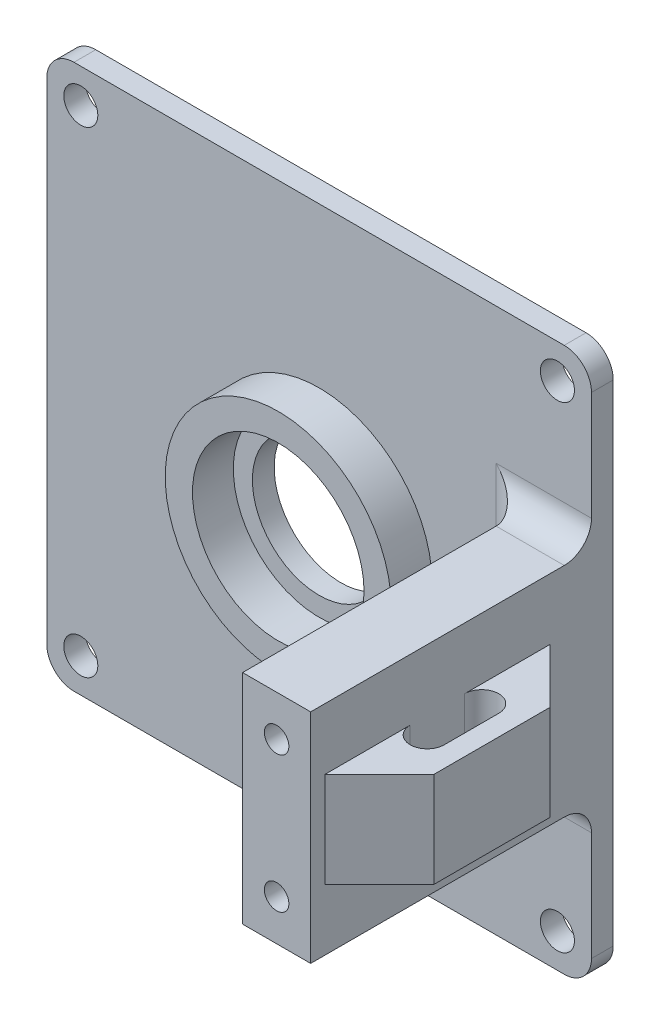
ISO-10303-21;
HEADER;
FILE_DESCRIPTION(('STEP AP214'),'2;1');
FILE_NAME('part.step','',(''),(''),'','','');
FILE_SCHEMA(('AUTOMOTIVE_DESIGN { 1 0 10303 214 1 1 1 1 }'));
ENDSEC;
DATA;
#1=APPLICATION_CONTEXT('core data for automotive mechanical design processes');
#2=APPLICATION_PROTOCOL_DEFINITION('international standard','automotive_design',2000,#1);
#3=PRODUCT_CONTEXT('',#1,'mechanical');
#4=PRODUCT('Part','Part','',(#3));
#5=PRODUCT_RELATED_PRODUCT_CATEGORY('part','',(#4));
#6=PRODUCT_DEFINITION_FORMATION('','',#4);
#7=PRODUCT_DEFINITION_CONTEXT('part definition',#1,'design');
#8=PRODUCT_DEFINITION('design','',#6,#7);
#9=PRODUCT_DEFINITION_SHAPE('','',#8);
#10=(LENGTH_UNIT() NAMED_UNIT(*) SI_UNIT(.MILLI.,.METRE.));
#11=(NAMED_UNIT(*) PLANE_ANGLE_UNIT() SI_UNIT($,.RADIAN.));
#12=(NAMED_UNIT(*) SI_UNIT($,.STERADIAN.) SOLID_ANGLE_UNIT());
#13=UNCERTAINTY_MEASURE_WITH_UNIT(LENGTH_MEASURE(1.E-05),#10,'distance_accuracy_value','');
#14=(GEOMETRIC_REPRESENTATION_CONTEXT(3) GLOBAL_UNCERTAINTY_ASSIGNED_CONTEXT((#13)) GLOBAL_UNIT_ASSIGNED_CONTEXT((#10,
#11,#12)) REPRESENTATION_CONTEXT('',''));
#15=CARTESIAN_POINT('',(0.,0.,0.));
#16=DIRECTION('',(0.,0.,1.));
#17=DIRECTION('',(1.,0.,0.));
#18=AXIS2_PLACEMENT_3D('',#15,#16,#17);
#19=CARTESIAN_POINT('',(0.,0.,2.032));
#20=DIRECTION('',(0.,0.,1.));
#21=DIRECTION('',(1.,0.,0.));
#22=AXIS2_PLACEMENT_3D('',#19,#20,#21);
#23=PLANE('',#22);
#24=CARTESIAN_POINT('',(3.175,47.625,2.032));
#25=DIRECTION('',(0.,0.,1.));
#26=DIRECTION('',(1.,0.,0.));
#27=AXIS2_PLACEMENT_3D('',#24,#25,#26);
#28=CIRCLE('',#27,1.5875);
#29=CARTESIAN_POINT('',(4.7625,47.625,2.032));
#30=VERTEX_POINT('',#29);
#31=EDGE_CURVE('E276',#30,#30,#28,.T.);
#32=ORIENTED_EDGE('',*,*,#31,.F.);
#33=EDGE_LOOP('',(#32));
#34=FACE_BOUND('',#33,.T.);
#35=CARTESIAN_POINT('',(3.175,3.175,2.032));
#36=DIRECTION('',(0.,0.,1.));
#37=DIRECTION('',(1.,0.,0.));
#38=AXIS2_PLACEMENT_3D('',#35,#36,#37);
#39=CIRCLE('',#38,1.5875);
#40=CARTESIAN_POINT('',(4.7625,3.175,2.032));
#41=VERTEX_POINT('',#40);
#42=EDGE_CURVE('E270',#41,#41,#39,.T.);
#43=ORIENTED_EDGE('',*,*,#42,.F.);
#44=EDGE_LOOP('',(#43));
#45=FACE_BOUND('',#44,.T.);
#46=CARTESIAN_POINT('',(47.625,3.17500000000001,2.032));
#47=DIRECTION('',(0.,0.,1.));
#48=DIRECTION('',(1.,0.,0.));
#49=AXIS2_PLACEMENT_3D('',#46,#47,#48);
#50=CIRCLE('',#49,1.5875);
#51=CARTESIAN_POINT('',(49.2125,3.17500000000001,2.032));
#52=VERTEX_POINT('',#51);
#53=EDGE_CURVE('E264',#52,#52,#50,.T.);
#54=ORIENTED_EDGE('',*,*,#53,.F.);
#55=EDGE_LOOP('',(#54));
#56=FACE_BOUND('',#55,.T.);
#57=CARTESIAN_POINT('',(47.625,47.625,2.032));
#58=DIRECTION('',(0.,0.,1.));
#59=DIRECTION('',(1.,0.,0.));
#60=AXIS2_PLACEMENT_3D('',#57,#58,#59);
#61=CIRCLE('',#60,1.5875);
#62=CARTESIAN_POINT('',(49.2125,47.625,2.032));
#63=VERTEX_POINT('',#62);
#64=EDGE_CURVE('E263',#63,#63,#61,.T.);
#65=ORIENTED_EDGE('',*,*,#64,.F.);
#66=EDGE_LOOP('',(#65));
#67=FACE_BOUND('',#66,.T.);
#68=CARTESIAN_POINT('',(25.4,25.4,2.032));
#69=DIRECTION('',(0.,0.,1.));
#70=DIRECTION('',(1.,0.,0.));
#71=AXIS2_PLACEMENT_3D('',#68,#69,#70);
#72=CIRCLE('',#71,10.541);
#73=CARTESIAN_POINT('',(35.941,25.4,2.032));
#74=VERTEX_POINT('',#73);
#75=EDGE_CURVE('E343',#74,#74,#72,.T.);
#76=ORIENTED_EDGE('',*,*,#75,.F.);
#77=EDGE_LOOP('',(#76));
#78=FACE_BOUND('',#77,.T.);
#79=DIRECTION('',(0.,1.,0.));
#80=VECTOR('',#79,1.);
#81=CARTESIAN_POINT('',(0.,0.,2.032));
#82=LINE('',#81,#80);
#83=CARTESIAN_POINT('',(0.,2.54,2.032));
#84=VERTEX_POINT('',#83);
#85=CARTESIAN_POINT('',(0.,48.26,2.032));
#86=VERTEX_POINT('',#85);
#87=EDGE_CURVE('E347',#84,#86,#82,.T.);
#88=ORIENTED_EDGE('',*,*,#87,.F.);
#89=CARTESIAN_POINT('',(2.54,2.54,2.032));
#90=DIRECTION('',(0.,0.,1.));
#91=DIRECTION('',(1.,0.,0.));
#92=AXIS2_PLACEMENT_3D('',#89,#90,#91);
#93=CIRCLE('',#92,2.54);
#94=CARTESIAN_POINT('',(2.54,0.,2.032));
#95=VERTEX_POINT('',#94);
#96=EDGE_CURVE('E418',#84,#95,#93,.T.);
#97=ORIENTED_EDGE('',*,*,#96,.T.);
#98=DIRECTION('',(1.,0.,0.));
#99=VECTOR('',#98,1.);
#100=CARTESIAN_POINT('',(0.,0.,2.032));
#101=LINE('',#100,#99);
#102=CARTESIAN_POINT('',(48.26,0.,2.032));
#103=VERTEX_POINT('',#102);
#104=EDGE_CURVE('E348',#95,#103,#101,.T.);
#105=ORIENTED_EDGE('',*,*,#104,.T.);
#106=CARTESIAN_POINT('',(48.26,2.54,2.032));
#107=DIRECTION('',(0.,0.,1.));
#108=DIRECTION('',(1.,0.,0.));
#109=AXIS2_PLACEMENT_3D('',#106,#107,#108);
#110=CIRCLE('',#109,2.54);
#111=CARTESIAN_POINT('',(50.8,2.54,2.032));
#112=VERTEX_POINT('',#111);
#113=EDGE_CURVE('E416',#103,#112,#110,.T.);
#114=ORIENTED_EDGE('',*,*,#113,.T.);
#115=DIRECTION('',(0.,1.,0.));
#116=VECTOR('',#115,1.);
#117=CARTESIAN_POINT('',(50.8,0.,2.032));
#118=LINE('',#117,#116);
#119=CARTESIAN_POINT('',(50.8,12.7,2.032));
#120=VERTEX_POINT('',#119);
#121=EDGE_CURVE('E353',#112,#120,#118,.T.);
#122=ORIENTED_EDGE('',*,*,#121,.T.);
#123=DIRECTION('',(-1.,0.,0.));
#124=VECTOR('',#123,1.);
#125=CARTESIAN_POINT('',(44.45,12.7,2.032));
#126=LINE('',#125,#124);
#127=CARTESIAN_POINT('',(41.91,12.7,2.032));
#128=VERTEX_POINT('',#127);
#129=EDGE_CURVE('E378',#120,#128,#126,.T.);
#130=ORIENTED_EDGE('',*,*,#129,.T.);
#131=DIRECTION('',(0.,-1.,0.));
#132=VECTOR('',#131,1.);
#133=CARTESIAN_POINT('',(41.91,0.,2.032));
#134=LINE('',#133,#132);
#135=CARTESIAN_POINT('',(41.91,38.1,2.032));
#136=VERTEX_POINT('',#135);
#137=EDGE_CURVE('E376',#128,#136,#134,.F.);
#138=ORIENTED_EDGE('',*,*,#137,.T.);
#139=DIRECTION('',(-1.,0.,0.));
#140=VECTOR('',#139,1.);
#141=CARTESIAN_POINT('',(0.,38.1,2.032));
#142=LINE('',#141,#140);
#143=CARTESIAN_POINT('',(50.8,38.1,2.032));
#144=VERTEX_POINT('',#143);
#145=EDGE_CURVE('E380',#136,#144,#142,.F.);
#146=ORIENTED_EDGE('',*,*,#145,.T.);
#147=CARTESIAN_POINT('',(50.8,48.26,2.032));
#148=VERTEX_POINT('',#147);
#149=EDGE_CURVE('E351',#144,#148,#118,.T.);
#150=ORIENTED_EDGE('',*,*,#149,.T.);
#151=CARTESIAN_POINT('',(48.26,48.26,2.032));
#152=DIRECTION('',(0.,0.,1.));
#153=DIRECTION('',(1.,0.,0.));
#154=AXIS2_PLACEMENT_3D('',#151,#152,#153);
#155=CIRCLE('',#154,2.54);
#156=CARTESIAN_POINT('',(48.26,50.8,2.032));
#157=VERTEX_POINT('',#156);
#158=EDGE_CURVE('E414',#148,#157,#155,.T.);
#159=ORIENTED_EDGE('',*,*,#158,.T.);
#160=DIRECTION('',(1.,0.,0.));
#161=VECTOR('',#160,1.);
#162=CARTESIAN_POINT('',(0.,50.8,2.032));
#163=LINE('',#162,#161);
#164=CARTESIAN_POINT('',(2.54,50.8,2.032));
#165=VERTEX_POINT('',#164);
#166=EDGE_CURVE('E355',#165,#157,#163,.T.);
#167=ORIENTED_EDGE('',*,*,#166,.F.);
#168=CARTESIAN_POINT('',(2.54,48.26,2.032));
#169=DIRECTION('',(0.,0.,1.));
#170=DIRECTION('',(1.,0.,0.));
#171=AXIS2_PLACEMENT_3D('',#168,#169,#170);
#172=CIRCLE('',#171,2.54);
#173=EDGE_CURVE('E412',#165,#86,#172,.T.);
#174=ORIENTED_EDGE('',*,*,#173,.T.);
#175=EDGE_LOOP('',(#88,#97,#105,#114,#122,#130,#138,#146,#150,#159,#167,#174));
#176=FACE_BOUND('',#175,.T.);
#177=ADVANCED_FACE('F43',(#34,#45,#56,#67,#78,#176),#23,.T.);
#178=CARTESIAN_POINT('',(0.,0.,2.032));
#179=DIRECTION('',(0.,1.,0.));
#180=DIRECTION('',(0.,0.,1.));
#181=AXIS2_PLACEMENT_3D('',#178,#179,#180);
#182=PLANE('',#181);
#183=ORIENTED_EDGE('',*,*,#104,.F.);
#184=DIRECTION('',(0.,0.,-1.));
#185=VECTOR('',#184,1.);
#186=CARTESIAN_POINT('',(2.54,0.,0.));
#187=LINE('',#186,#185);
#188=CARTESIAN_POINT('',(2.54,0.,0.));
#189=VERTEX_POINT('',#188);
#190=EDGE_CURVE('E396',#95,#189,#187,.T.);
#191=ORIENTED_EDGE('',*,*,#190,.T.);
#192=DIRECTION('',(1.,0.,0.));
#193=VECTOR('',#192,1.);
#194=CARTESIAN_POINT('',(0.,0.,0.));
#195=LINE('',#194,#193);
#196=CARTESIAN_POINT('',(48.26,0.,0.));
#197=VERTEX_POINT('',#196);
#198=EDGE_CURVE('E342',#189,#197,#195,.T.);
#199=ORIENTED_EDGE('',*,*,#198,.T.);
#200=DIRECTION('',(0.,0.,-1.));
#201=VECTOR('',#200,1.);
#202=CARTESIAN_POINT('',(48.26,0.,2.032));
#203=LINE('',#202,#201);
#204=EDGE_CURVE('E391',#197,#103,#203,.F.);
#205=ORIENTED_EDGE('',*,*,#204,.T.);
#206=EDGE_LOOP('',(#183,#191,#199,#205));
#207=FACE_BOUND('',#206,.T.);
#208=ADVANCED_FACE('F450',(#207),#182,.F.);
#209=CARTESIAN_POINT('',(50.8,0.,2.032));
#210=DIRECTION('',(-1.,0.,0.));
#211=DIRECTION('',(0.,0.,1.));
#212=AXIS2_PLACEMENT_3D('',#209,#210,#211);
#213=PLANE('',#212);
#214=DIRECTION('',(0.,1.,0.));
#215=VECTOR('',#214,1.);
#216=CARTESIAN_POINT('',(50.8,20.955,5.91820000000006));
#217=LINE('',#216,#215);
#218=CARTESIAN_POINT('',(50.8,20.955,5.91820000000005));
#219=VERTEX_POINT('',#218);
#220=CARTESIAN_POINT('',(50.8,29.845,5.91820000000006));
#221=VERTEX_POINT('',#220);
#222=EDGE_CURVE('E63',#219,#221,#217,.T.);
#223=ORIENTED_EDGE('',*,*,#222,.F.);
#224=DIRECTION('',(0.,0.,1.));
#225=VECTOR('',#224,1.);
#226=CARTESIAN_POINT('',(50.8,20.955,0.));
#227=LINE('',#226,#225);
#228=CARTESIAN_POINT('',(50.8,20.955,13.8557));
#229=VERTEX_POINT('',#228);
#230=EDGE_CURVE('E58',#219,#229,#227,.T.);
#231=ORIENTED_EDGE('',*,*,#230,.T.);
#232=DIRECTION('',(0.,1.,0.));
#233=VECTOR('',#232,1.);
#234=CARTESIAN_POINT('',(50.8,20.955,13.8557));
#235=LINE('',#234,#233);
#236=CARTESIAN_POINT('',(50.8,29.845,13.8557));
#237=VERTEX_POINT('',#236);
#238=EDGE_CURVE('E257',#229,#237,#235,.T.);
#239=ORIENTED_EDGE('',*,*,#238,.T.);
#240=DIRECTION('',(0.,0.,1.));
#241=VECTOR('',#240,1.);
#242=CARTESIAN_POINT('',(50.8,29.845,0.));
#243=LINE('',#242,#241);
#244=EDGE_CURVE('E236',#221,#237,#243,.T.);
#245=ORIENTED_EDGE('',*,*,#244,.F.);
#246=EDGE_LOOP('',(#223,#231,#239,#245));
#247=FACE_BOUND('',#246,.T.);
#248=DIRECTION('',(0.,1.,0.));
#249=VECTOR('',#248,1.);
#250=CARTESIAN_POINT('',(50.8,20.955,18.9357));
#251=LINE('',#250,#249);
#252=CARTESIAN_POINT('',(50.8,20.955,18.9357));
#253=VERTEX_POINT('',#252);
#254=CARTESIAN_POINT('',(50.8,29.845,18.9357));
#255=VERTEX_POINT('',#254);
#256=EDGE_CURVE('E229',#253,#255,#251,.T.);
#257=ORIENTED_EDGE('',*,*,#256,.F.);
#258=DIRECTION('',(0.,0.,-1.));
#259=VECTOR('',#258,1.);
#260=CARTESIAN_POINT('',(50.8,20.955,0.));
#261=LINE('',#260,#259);
#262=CARTESIAN_POINT('',(50.8,20.955,26.8732));
#263=VERTEX_POINT('',#262);
#264=EDGE_CURVE('E212',#263,#253,#261,.T.);
#265=ORIENTED_EDGE('',*,*,#264,.F.);
#266=DIRECTION('',(0.,1.,0.));
#267=VECTOR('',#266,1.);
#268=CARTESIAN_POINT('',(50.8,20.955,26.8732));
#269=LINE('',#268,#267);
#270=CARTESIAN_POINT('',(50.8,29.845,26.8732));
#271=VERTEX_POINT('',#270);
#272=EDGE_CURVE('E249',#263,#271,#269,.T.);
#273=ORIENTED_EDGE('',*,*,#272,.T.);
#274=DIRECTION('',(0.,0.,-1.));
#275=VECTOR('',#274,1.);
#276=CARTESIAN_POINT('',(50.8,29.845,0.));
#277=LINE('',#276,#275);
#278=EDGE_CURVE('E213',#271,#255,#277,.T.);
#279=ORIENTED_EDGE('',*,*,#278,.T.);
#280=EDGE_LOOP('',(#257,#265,#273,#279));
#281=FACE_BOUND('',#280,.T.);
#282=ORIENTED_EDGE('',*,*,#121,.F.);
#283=DIRECTION('',(0.,0.,-1.));
#284=VECTOR('',#283,1.);
#285=CARTESIAN_POINT('',(50.8,2.54,2.032));
#286=LINE('',#285,#284);
#287=CARTESIAN_POINT('',(50.8,2.54,0.));
#288=VERTEX_POINT('',#287);
#289=EDGE_CURVE('E422',#112,#288,#286,.T.);
#290=ORIENTED_EDGE('',*,*,#289,.T.);
#291=DIRECTION('',(0.,1.,0.));
#292=VECTOR('',#291,1.);
#293=CARTESIAN_POINT('',(50.8,0.,0.));
#294=LINE('',#293,#292);
#295=CARTESIAN_POINT('',(50.8,48.26,0.));
#296=VERTEX_POINT('',#295);
#297=EDGE_CURVE('E362',#288,#296,#294,.T.);
#298=ORIENTED_EDGE('',*,*,#297,.T.);
#299=DIRECTION('',(0.,0.,-1.));
#300=VECTOR('',#299,1.);
#301=CARTESIAN_POINT('',(50.8,48.26,2.032));
#302=LINE('',#301,#300);
#303=EDGE_CURVE('E420',#296,#148,#302,.F.);
#304=ORIENTED_EDGE('',*,*,#303,.T.);
#305=ORIENTED_EDGE('',*,*,#149,.F.);
#306=CARTESIAN_POINT('',(50.8,38.1,4.572));
#307=DIRECTION('',(-1.,0.,0.));
#308=DIRECTION('',(0.,0.,1.));
#309=AXIS2_PLACEMENT_3D('',#306,#307,#308);
#310=CIRCLE('',#309,2.54);
#311=CARTESIAN_POINT('',(50.8,35.56,4.572));
#312=VERTEX_POINT('',#311);
#313=EDGE_CURVE('E386',#144,#312,#310,.T.);
#314=ORIENTED_EDGE('',*,*,#313,.T.);
#315=DIRECTION('',(0.,0.,-1.));
#316=VECTOR('',#315,1.);
#317=CARTESIAN_POINT('',(50.8,35.56,28.2194));
#318=LINE('',#317,#316);
#319=CARTESIAN_POINT('',(50.8,35.56,28.2194));
#320=VERTEX_POINT('',#319);
#321=EDGE_CURVE('E316',#320,#312,#318,.T.);
#322=ORIENTED_EDGE('',*,*,#321,.F.);
#323=DIRECTION('',(0.,-1.,0.));
#324=VECTOR('',#323,1.);
#325=CARTESIAN_POINT('',(50.8,35.56,28.2194));
#326=LINE('',#325,#324);
#327=CARTESIAN_POINT('',(50.8,15.24,28.2194));
#328=VERTEX_POINT('',#327);
#329=EDGE_CURVE('E295',#320,#328,#326,.T.);
#330=ORIENTED_EDGE('',*,*,#329,.T.);
#331=DIRECTION('',(0.,0.,-1.));
#332=VECTOR('',#331,1.);
#333=CARTESIAN_POINT('',(50.8,15.24,28.2194));
#334=LINE('',#333,#332);
#335=CARTESIAN_POINT('',(50.8,15.24,4.572));
#336=VERTEX_POINT('',#335);
#337=EDGE_CURVE('E315',#328,#336,#334,.T.);
#338=ORIENTED_EDGE('',*,*,#337,.T.);
#339=CARTESIAN_POINT('',(50.8,12.7,4.572));
#340=DIRECTION('',(-1.,0.,0.));
#341=DIRECTION('',(0.,0.,1.));
#342=AXIS2_PLACEMENT_3D('',#339,#340,#341);
#343=CIRCLE('',#342,2.54);
#344=EDGE_CURVE('E388',#336,#120,#343,.T.);
#345=ORIENTED_EDGE('',*,*,#344,.T.);
#346=EDGE_LOOP('',(#282,#290,#298,#304,#305,#314,#322,#330,#338,#345));
#347=FACE_BOUND('',#346,.T.);
#348=ADVANCED_FACE('F459',(#247,#281,#347),#213,.F.);
#349=CARTESIAN_POINT('',(0.,50.8,2.032));
#350=DIRECTION('',(0.,1.,0.));
#351=DIRECTION('',(0.,0.,1.));
#352=AXIS2_PLACEMENT_3D('',#349,#350,#351);
#353=PLANE('',#352);
#354=ORIENTED_EDGE('',*,*,#166,.T.);
#355=DIRECTION('',(0.,0.,-1.));
#356=VECTOR('',#355,1.);
#357=CARTESIAN_POINT('',(48.26,50.8,0.));
#358=LINE('',#357,#356);
#359=CARTESIAN_POINT('',(48.26,50.8,0.));
#360=VERTEX_POINT('',#359);
#361=EDGE_CURVE('E12',#157,#360,#358,.T.);
#362=ORIENTED_EDGE('',*,*,#361,.T.);
#363=DIRECTION('',(1.,0.,0.));
#364=VECTOR('',#363,1.);
#365=CARTESIAN_POINT('',(0.,50.8,0.));
#366=LINE('',#365,#364);
#367=CARTESIAN_POINT('',(2.54,50.8,0.));
#368=VERTEX_POINT('',#367);
#369=EDGE_CURVE('E365',#368,#360,#366,.T.);
#370=ORIENTED_EDGE('',*,*,#369,.F.);
#371=DIRECTION('',(0.,0.,-1.));
#372=VECTOR('',#371,1.);
#373=CARTESIAN_POINT('',(2.54,50.8,2.032));
#374=LINE('',#373,#372);
#375=EDGE_CURVE('E51',#368,#165,#374,.F.);
#376=ORIENTED_EDGE('',*,*,#375,.T.);
#377=EDGE_LOOP('',(#354,#362,#370,#376));
#378=FACE_BOUND('',#377,.T.);
#379=ADVANCED_FACE('F428',(#378),#353,.T.);
#380=CARTESIAN_POINT('',(0.,0.,2.032));
#381=DIRECTION('',(-1.,0.,0.));
#382=DIRECTION('',(0.,0.,1.));
#383=AXIS2_PLACEMENT_3D('',#380,#381,#382);
#384=PLANE('',#383);
#385=DIRECTION('',(0.,1.,0.));
#386=VECTOR('',#385,1.);
#387=CARTESIAN_POINT('',(0.,0.,0.));
#388=LINE('',#387,#386);
#389=CARTESIAN_POINT('',(0.,2.54,0.));
#390=VERTEX_POINT('',#389);
#391=CARTESIAN_POINT('',(0.,48.26,0.));
#392=VERTEX_POINT('',#391);
#393=EDGE_CURVE('E352',#390,#392,#388,.T.);
#394=ORIENTED_EDGE('',*,*,#393,.F.);
#395=DIRECTION('',(0.,0.,-1.));
#396=VECTOR('',#395,1.);
#397=CARTESIAN_POINT('',(0.,2.54,2.032));
#398=LINE('',#397,#396);
#399=EDGE_CURVE('E410',#390,#84,#398,.F.);
#400=ORIENTED_EDGE('',*,*,#399,.T.);
#401=ORIENTED_EDGE('',*,*,#87,.T.);
#402=DIRECTION('',(0.,0.,-1.));
#403=VECTOR('',#402,1.);
#404=CARTESIAN_POINT('',(0.,48.26,2.032));
#405=LINE('',#404,#403);
#406=EDGE_CURVE('E407',#86,#392,#405,.T.);
#407=ORIENTED_EDGE('',*,*,#406,.T.);
#408=EDGE_LOOP('',(#394,#400,#401,#407));
#409=FACE_BOUND('',#408,.T.);
#410=ADVANCED_FACE('F439',(#409),#384,.T.);
#411=CARTESIAN_POINT('',(0.,0.,0.));
#412=DIRECTION('',(0.,0.,1.));
#413=DIRECTION('',(1.,0.,0.));
#414=AXIS2_PLACEMENT_3D('',#411,#412,#413);
#415=PLANE('',#414);
#416=CARTESIAN_POINT('',(3.175,47.625,0.));
#417=DIRECTION('',(0.,0.,1.));
#418=DIRECTION('',(1.,0.,0.));
#419=AXIS2_PLACEMENT_3D('',#416,#417,#418);
#420=CIRCLE('',#419,1.5875);
#421=CARTESIAN_POINT('',(4.7625,47.625,0.));
#422=VERTEX_POINT('',#421);
#423=EDGE_CURVE('E273',#422,#422,#420,.T.);
#424=ORIENTED_EDGE('',*,*,#423,.T.);
#425=EDGE_LOOP('',(#424));
#426=FACE_BOUND('',#425,.T.);
#427=CARTESIAN_POINT('',(3.175,3.175,0.));
#428=DIRECTION('',(0.,0.,1.));
#429=DIRECTION('',(1.,0.,0.));
#430=AXIS2_PLACEMENT_3D('',#427,#428,#429);
#431=CIRCLE('',#430,1.5875);
#432=CARTESIAN_POINT('',(4.7625,3.175,0.));
#433=VERTEX_POINT('',#432);
#434=EDGE_CURVE('E267',#433,#433,#431,.T.);
#435=ORIENTED_EDGE('',*,*,#434,.T.);
#436=EDGE_LOOP('',(#435));
#437=FACE_BOUND('',#436,.T.);
#438=CARTESIAN_POINT('',(47.625,3.17500000000001,0.));
#439=DIRECTION('',(0.,0.,1.));
#440=DIRECTION('',(1.,0.,0.));
#441=AXIS2_PLACEMENT_3D('',#438,#439,#440);
#442=CIRCLE('',#441,1.5875);
#443=CARTESIAN_POINT('',(49.2125,3.17500000000001,0.));
#444=VERTEX_POINT('',#443);
#445=EDGE_CURVE('E260',#444,#444,#442,.T.);
#446=ORIENTED_EDGE('',*,*,#445,.T.);
#447=EDGE_LOOP('',(#446));
#448=FACE_BOUND('',#447,.T.);
#449=CARTESIAN_POINT('',(47.625,47.625,0.));
#450=DIRECTION('',(0.,0.,1.));
#451=DIRECTION('',(1.,0.,0.));
#452=AXIS2_PLACEMENT_3D('',#449,#450,#451);
#453=CIRCLE('',#452,1.5875);
#454=CARTESIAN_POINT('',(49.2125,47.625,0.));
#455=VERTEX_POINT('',#454);
#456=EDGE_CURVE('E280',#455,#455,#453,.T.);
#457=ORIENTED_EDGE('',*,*,#456,.T.);
#458=EDGE_LOOP('',(#457));
#459=FACE_BOUND('',#458,.T.);
#460=CARTESIAN_POINT('',(25.4,25.4,0.));
#461=DIRECTION('',(0.,0.,1.));
#462=DIRECTION('',(1.,0.,0.));
#463=AXIS2_PLACEMENT_3D('',#460,#461,#462);
#464=CIRCLE('',#463,6.223);
#465=CARTESIAN_POINT('',(31.623,25.4,0.));
#466=VERTEX_POINT('',#465);
#467=EDGE_CURVE('E328',#466,#466,#464,.T.);
#468=ORIENTED_EDGE('',*,*,#467,.T.);
#469=EDGE_LOOP('',(#468));
#470=FACE_BOUND('',#469,.T.);
#471=ORIENTED_EDGE('',*,*,#198,.F.);
#472=CARTESIAN_POINT('',(2.54,2.54,0.));
#473=DIRECTION('',(0.,0.,1.));
#474=DIRECTION('',(1.,0.,0.));
#475=AXIS2_PLACEMENT_3D('',#472,#473,#474);
#476=CIRCLE('',#475,2.54);
#477=EDGE_CURVE('E405',#189,#390,#476,.F.);
#478=ORIENTED_EDGE('',*,*,#477,.T.);
#479=ORIENTED_EDGE('',*,*,#393,.T.);
#480=CARTESIAN_POINT('',(2.54,48.26,0.));
#481=DIRECTION('',(0.,0.,1.));
#482=DIRECTION('',(1.,0.,0.));
#483=AXIS2_PLACEMENT_3D('',#480,#481,#482);
#484=CIRCLE('',#483,2.54);
#485=EDGE_CURVE('E399',#392,#368,#484,.F.);
#486=ORIENTED_EDGE('',*,*,#485,.T.);
#487=ORIENTED_EDGE('',*,*,#369,.T.);
#488=CARTESIAN_POINT('',(48.26,48.26,0.));
#489=DIRECTION('',(0.,0.,1.));
#490=DIRECTION('',(1.,0.,0.));
#491=AXIS2_PLACEMENT_3D('',#488,#489,#490);
#492=CIRCLE('',#491,2.54);
#493=EDGE_CURVE('E401',#360,#296,#492,.F.);
#494=ORIENTED_EDGE('',*,*,#493,.T.);
#495=ORIENTED_EDGE('',*,*,#297,.F.);
#496=CARTESIAN_POINT('',(48.26,2.54,0.));
#497=DIRECTION('',(0.,0.,1.));
#498=DIRECTION('',(1.,0.,0.));
#499=AXIS2_PLACEMENT_3D('',#496,#497,#498);
#500=CIRCLE('',#499,2.54);
#501=EDGE_CURVE('E403',#288,#197,#500,.F.);
#502=ORIENTED_EDGE('',*,*,#501,.T.);
#503=EDGE_LOOP('',(#471,#478,#479,#486,#487,#494,#495,#502));
#504=FACE_BOUND('',#503,.T.);
#505=ADVANCED_FACE('F443',(#426,#437,#448,#459,#470,#504),#415,.F.);
#506=CARTESIAN_POINT('',(25.4,25.4,5.842));
#507=DIRECTION('',(0.,0.,-1.));
#508=DIRECTION('',(-1.,0.,0.));
#509=AXIS2_PLACEMENT_3D('',#506,#507,#508);
#510=CYLINDRICAL_SURFACE('',#509,10.541);
#511=CARTESIAN_POINT('',(25.4,25.4,5.842));
#512=DIRECTION('',(0.,0.,1.));
#513=DIRECTION('',(1.,0.,0.));
#514=AXIS2_PLACEMENT_3D('',#511,#512,#513);
#515=CIRCLE('',#514,10.541);
#516=CARTESIAN_POINT('',(35.941,25.4,5.842));
#517=VERTEX_POINT('',#516);
#518=EDGE_CURVE('E337',#517,#517,#515,.T.);
#519=ORIENTED_EDGE('',*,*,#518,.F.);
#520=EDGE_LOOP('',(#519));
#521=FACE_BOUND('',#520,.T.);
#522=ORIENTED_EDGE('',*,*,#75,.T.);
#523=EDGE_LOOP('',(#522));
#524=FACE_BOUND('',#523,.T.);
#525=ADVANCED_FACE('F517',(#521,#524),#510,.T.);
#526=CARTESIAN_POINT('',(0.,0.,5.842));
#527=DIRECTION('',(0.,0.,1.));
#528=DIRECTION('',(1.,0.,0.));
#529=AXIS2_PLACEMENT_3D('',#526,#527,#528);
#530=PLANE('',#529);
#531=CARTESIAN_POINT('',(25.4,25.4,5.842));
#532=DIRECTION('',(0.,0.,1.));
#533=DIRECTION('',(1.,0.,0.));
#534=AXIS2_PLACEMENT_3D('',#531,#532,#533);
#535=CIRCLE('',#534,8.001);
#536=CARTESIAN_POINT('',(33.401,25.4,5.842));
#537=VERTEX_POINT('',#536);
#538=EDGE_CURVE('E334',#537,#537,#535,.T.);
#539=ORIENTED_EDGE('',*,*,#538,.F.);
#540=EDGE_LOOP('',(#539));
#541=FACE_BOUND('',#540,.T.);
#542=ORIENTED_EDGE('',*,*,#518,.T.);
#543=EDGE_LOOP('',(#542));
#544=FACE_BOUND('',#543,.T.);
#545=ADVANCED_FACE('F617',(#541,#544),#530,.T.);
#546=CARTESIAN_POINT('',(25.4,25.4,5.842));
#547=DIRECTION('',(0.,0.,-1.));
#548=DIRECTION('',(-1.,0.,0.));
#549=AXIS2_PLACEMENT_3D('',#546,#547,#548);
#550=CYLINDRICAL_SURFACE('',#549,8.001);
#551=ORIENTED_EDGE('',*,*,#538,.T.);
#552=EDGE_LOOP('',(#551));
#553=FACE_BOUND('',#552,.T.);
#554=CARTESIAN_POINT('',(25.4,25.4,2.032));
#555=DIRECTION('',(0.,0.,1.));
#556=DIRECTION('',(1.,0.,0.));
#557=AXIS2_PLACEMENT_3D('',#554,#555,#556);
#558=CIRCLE('',#557,8.001);
#559=CARTESIAN_POINT('',(33.401,25.4,2.032));
#560=VERTEX_POINT('',#559);
#561=EDGE_CURVE('E331',#560,#560,#558,.T.);
#562=ORIENTED_EDGE('',*,*,#561,.F.);
#563=EDGE_LOOP('',(#562));
#564=FACE_BOUND('',#563,.T.);
#565=ADVANCED_FACE('F610',(#553,#564),#550,.F.);
#566=CARTESIAN_POINT('',(25.4,25.4,2.032));
#567=DIRECTION('',(0.,0.,1.));
#568=DIRECTION('',(1.,0.,0.));
#569=AXIS2_PLACEMENT_3D('',#566,#567,#568);
#570=PLANE('',#569);
#571=CARTESIAN_POINT('',(25.4,25.4,2.032));
#572=DIRECTION('',(0.,0.,1.));
#573=DIRECTION('',(1.,0.,0.));
#574=AXIS2_PLACEMENT_3D('',#571,#572,#573);
#575=CIRCLE('',#574,6.223);
#576=CARTESIAN_POINT('',(31.623,25.4,2.032));
#577=VERTEX_POINT('',#576);
#578=EDGE_CURVE('E319',#577,#577,#575,.T.);
#579=ORIENTED_EDGE('',*,*,#578,.F.);
#580=EDGE_LOOP('',(#579));
#581=FACE_BOUND('',#580,.T.);
#582=ORIENTED_EDGE('',*,*,#561,.T.);
#583=EDGE_LOOP('',(#582));
#584=FACE_BOUND('',#583,.T.);
#585=ADVANCED_FACE('F604',(#581,#584),#570,.T.);
#586=CARTESIAN_POINT('',(25.4,25.4,0.));
#587=DIRECTION('',(0.,0.,1.));
#588=DIRECTION('',(1.,0.,0.));
#589=AXIS2_PLACEMENT_3D('',#586,#587,#588);
#590=CYLINDRICAL_SURFACE('',#589,6.223);
#591=ORIENTED_EDGE('',*,*,#467,.F.);
#592=EDGE_LOOP('',(#591));
#593=FACE_BOUND('',#592,.T.);
#594=ORIENTED_EDGE('',*,*,#578,.T.);
#595=EDGE_LOOP('',(#594));
#596=FACE_BOUND('',#595,.T.);
#597=ADVANCED_FACE('F600',(#593,#596),#590,.F.);
#598=CARTESIAN_POINT('',(50.8,35.56,28.2194));
#599=DIRECTION('',(0.,-1.,0.));
#600=DIRECTION('',(0.,0.,-1.));
#601=AXIS2_PLACEMENT_3D('',#598,#599,#600);
#602=PLANE('',#601);
#603=ORIENTED_EDGE('',*,*,#321,.T.);
#604=DIRECTION('',(-1.,0.,0.));
#605=VECTOR('',#604,1.);
#606=CARTESIAN_POINT('',(50.8,35.56,4.572));
#607=LINE('',#606,#605);
#608=CARTESIAN_POINT('',(44.45,35.56,4.572));
#609=VERTEX_POINT('',#608);
#610=EDGE_CURVE('E346',#312,#609,#607,.T.);
#611=ORIENTED_EDGE('',*,*,#610,.T.);
#612=DIRECTION('',(0.,0.,-1.));
#613=VECTOR('',#612,1.);
#614=CARTESIAN_POINT('',(44.45,35.56,28.2194));
#615=LINE('',#614,#613);
#616=CARTESIAN_POINT('',(44.45,35.56,28.2194));
#617=VERTEX_POINT('',#616);
#618=EDGE_CURVE('E320',#617,#609,#615,.T.);
#619=ORIENTED_EDGE('',*,*,#618,.F.);
#620=DIRECTION('',(-1.,0.,0.));
#621=VECTOR('',#620,1.);
#622=CARTESIAN_POINT('',(50.8,35.56,28.2194));
#623=LINE('',#622,#621);
#624=EDGE_CURVE('E313',#320,#617,#623,.T.);
#625=ORIENTED_EDGE('',*,*,#624,.F.);
#626=EDGE_LOOP('',(#603,#611,#619,#625));
#627=FACE_BOUND('',#626,.T.);
#628=ADVANCED_FACE('F479',(#627),#602,.F.);
#629=CARTESIAN_POINT('',(44.45,35.56,28.2194));
#630=DIRECTION('',(1.,0.,0.));
#631=DIRECTION('',(0.,0.,-1.));
#632=AXIS2_PLACEMENT_3D('',#629,#630,#631);
#633=PLANE('',#632);
#634=ORIENTED_EDGE('',*,*,#618,.T.);
#635=DIRECTION('',(0.,-1.,0.));
#636=VECTOR('',#635,1.);
#637=CARTESIAN_POINT('',(44.45,35.56,4.572));
#638=LINE('',#637,#636);
#639=CARTESIAN_POINT('',(44.45,15.24,4.572));
#640=VERTEX_POINT('',#639);
#641=EDGE_CURVE('E384',#609,#640,#638,.T.);
#642=ORIENTED_EDGE('',*,*,#641,.T.);
#643=DIRECTION('',(0.,0.,-1.));
#644=VECTOR('',#643,1.);
#645=CARTESIAN_POINT('',(44.45,15.24,28.2194));
#646=LINE('',#645,#644);
#647=CARTESIAN_POINT('',(44.45,15.24,28.2194));
#648=VERTEX_POINT('',#647);
#649=EDGE_CURVE('E323',#648,#640,#646,.T.);
#650=ORIENTED_EDGE('',*,*,#649,.F.);
#651=DIRECTION('',(0.,-1.,0.));
#652=VECTOR('',#651,1.);
#653=CARTESIAN_POINT('',(44.45,35.56,28.2194));
#654=LINE('',#653,#652);
#655=EDGE_CURVE('E311',#617,#648,#654,.T.);
#656=ORIENTED_EDGE('',*,*,#655,.F.);
#657=EDGE_LOOP('',(#634,#642,#650,#656));
#658=FACE_BOUND('',#657,.T.);
#659=ADVANCED_FACE('F482',(#658),#633,.F.);
#660=CARTESIAN_POINT('',(50.8,15.24,28.2194));
#661=DIRECTION('',(0.,-1.,0.));
#662=DIRECTION('',(1.,0.,0.));
#663=AXIS2_PLACEMENT_3D('',#660,#661,#662);
#664=PLANE('',#663);
#665=ORIENTED_EDGE('',*,*,#649,.T.);
#666=DIRECTION('',(-1.,0.,0.));
#667=VECTOR('',#666,1.);
#668=CARTESIAN_POINT('',(50.8,15.24,4.572));
#669=LINE('',#668,#667);
#670=EDGE_CURVE('E382',#640,#336,#669,.F.);
#671=ORIENTED_EDGE('',*,*,#670,.T.);
#672=ORIENTED_EDGE('',*,*,#337,.F.);
#673=DIRECTION('',(-1.,0.,0.));
#674=VECTOR('',#673,1.);
#675=CARTESIAN_POINT('',(50.8,15.24,28.2194));
#676=LINE('',#675,#674);
#677=EDGE_CURVE('E308',#328,#648,#676,.T.);
#678=ORIENTED_EDGE('',*,*,#677,.T.);
#679=EDGE_LOOP('',(#665,#671,#672,#678));
#680=FACE_BOUND('',#679,.T.);
#681=ADVANCED_FACE('F493',(#680),#664,.T.);
#682=CARTESIAN_POINT('',(0.,0.,28.2194));
#683=DIRECTION('',(0.,0.,-1.));
#684=DIRECTION('',(-1.,0.,0.));
#685=AXIS2_PLACEMENT_3D('',#682,#683,#684);
#686=PLANE('',#685);
#687=CARTESIAN_POINT('',(47.625,31.75,28.2194));
#688=DIRECTION('',(0.,0.,-1.));
#689=DIRECTION('',(-1.,0.,0.));
#690=AXIS2_PLACEMENT_3D('',#687,#688,#689);
#691=CIRCLE('',#690,1.143);
#692=CARTESIAN_POINT('',(46.482,31.75,28.2194));
#693=VERTEX_POINT('',#692);
#694=EDGE_CURVE('E296',#693,#693,#691,.T.);
#695=ORIENTED_EDGE('',*,*,#694,.T.);
#696=EDGE_LOOP('',(#695));
#697=FACE_BOUND('',#696,.T.);
#698=CARTESIAN_POINT('',(47.625,19.05,28.2194));
#699=DIRECTION('',(0.,0.,-1.));
#700=DIRECTION('',(-1.,0.,0.));
#701=AXIS2_PLACEMENT_3D('',#698,#699,#700);
#702=CIRCLE('',#701,1.143);
#703=CARTESIAN_POINT('',(46.482,19.05,28.2194));
#704=VERTEX_POINT('',#703);
#705=EDGE_CURVE('E299',#704,#704,#702,.T.);
#706=ORIENTED_EDGE('',*,*,#705,.T.);
#707=EDGE_LOOP('',(#706));
#708=FACE_BOUND('',#707,.T.);
#709=ORIENTED_EDGE('',*,*,#329,.F.);
#710=ORIENTED_EDGE('',*,*,#624,.T.);
#711=ORIENTED_EDGE('',*,*,#655,.T.);
#712=ORIENTED_EDGE('',*,*,#677,.F.);
#713=EDGE_LOOP('',(#709,#710,#711,#712));
#714=FACE_BOUND('',#713,.T.);
#715=ADVANCED_FACE('F486',(#697,#708,#714),#686,.F.);
#716=CARTESIAN_POINT('',(47.625,19.05,25.6794));
#717=DIRECTION('',(0.,0.,1.));
#718=DIRECTION('',(1.,0.,0.));
#719=AXIS2_PLACEMENT_3D('',#716,#717,#718);
#720=CYLINDRICAL_SURFACE('',#719,1.143);
#721=CARTESIAN_POINT('',(47.625,19.05,25.6794));
#722=DIRECTION('',(0.,0.,-1.));
#723=DIRECTION('',(-1.,0.,0.));
#724=AXIS2_PLACEMENT_3D('',#721,#722,#723);
#725=CIRCLE('',#724,1.143);
#726=CARTESIAN_POINT('',(46.482,19.05,25.6794));
#727=VERTEX_POINT('',#726);
#728=EDGE_CURVE('E302',#727,#727,#725,.T.);
#729=ORIENTED_EDGE('',*,*,#728,.T.);
#730=EDGE_LOOP('',(#729));
#731=FACE_BOUND('',#730,.T.);
#732=ORIENTED_EDGE('',*,*,#705,.F.);
#733=EDGE_LOOP('',(#732));
#734=FACE_BOUND('',#733,.T.);
#735=ADVANCED_FACE('F500',(#731,#734),#720,.F.);
#736=CARTESIAN_POINT('',(47.625,19.05,25.6794));
#737=DIRECTION('',(0.,0.,-1.));
#738=DIRECTION('',(-1.,0.,0.));
#739=AXIS2_PLACEMENT_3D('',#736,#737,#738);
#740=PLANE('',#739);
#741=CARTESIAN_POINT('',(47.625,19.05,25.6794));
#742=DIRECTION('',(0.,0.,-1.));
#743=DIRECTION('',(-1.,0.,0.));
#744=AXIS2_PLACEMENT_3D('',#741,#742,#743);
#745=CIRCLE('',#744,0.952500000000003);
#746=CARTESIAN_POINT('',(46.6725,19.05,25.6794));
#747=VERTEX_POINT('',#746);
#748=EDGE_CURVE('E305',#747,#747,#745,.F.);
#749=ORIENTED_EDGE('',*,*,#748,.F.);
#750=EDGE_LOOP('',(#749));
#751=FACE_BOUND('',#750,.T.);
#752=ORIENTED_EDGE('',*,*,#728,.F.);
#753=EDGE_LOOP('',(#752));
#754=FACE_BOUND('',#753,.T.);
#755=ADVANCED_FACE('F591',(#751,#754),#740,.F.);
#756=CARTESIAN_POINT('',(47.625,31.75,25.6794));
#757=DIRECTION('',(0.,0.,1.));
#758=DIRECTION('',(1.,0.,0.));
#759=AXIS2_PLACEMENT_3D('',#756,#757,#758);
#760=CYLINDRICAL_SURFACE('',#759,1.143);
#761=CARTESIAN_POINT('',(47.625,31.75,25.6794));
#762=DIRECTION('',(0.,0.,-1.));
#763=DIRECTION('',(-1.,0.,0.));
#764=AXIS2_PLACEMENT_3D('',#761,#762,#763);
#765=CIRCLE('',#764,1.143);
#766=CARTESIAN_POINT('',(46.482,31.75,25.6794));
#767=VERTEX_POINT('',#766);
#768=EDGE_CURVE('E292',#767,#767,#765,.T.);
#769=ORIENTED_EDGE('',*,*,#768,.T.);
#770=EDGE_LOOP('',(#769));
#771=FACE_BOUND('',#770,.T.);
#772=ORIENTED_EDGE('',*,*,#694,.F.);
#773=EDGE_LOOP('',(#772));
#774=FACE_BOUND('',#773,.T.);
#775=ADVANCED_FACE('F587',(#771,#774),#760,.F.);
#776=CARTESIAN_POINT('',(47.625,31.75,25.6794));
#777=DIRECTION('',(0.,0.,-1.));
#778=DIRECTION('',(-1.,0.,0.));
#779=AXIS2_PLACEMENT_3D('',#776,#777,#778);
#780=PLANE('',#779);
#781=CARTESIAN_POINT('',(47.625,31.75,25.6794));
#782=DIRECTION('',(0.,0.,-1.));
#783=DIRECTION('',(-1.,0.,0.));
#784=AXIS2_PLACEMENT_3D('',#781,#782,#783);
#785=CIRCLE('',#784,0.952500000000004);
#786=CARTESIAN_POINT('',(46.6725,31.75,25.6794));
#787=VERTEX_POINT('',#786);
#788=EDGE_CURVE('E289',#787,#787,#785,.F.);
#789=ORIENTED_EDGE('',*,*,#788,.F.);
#790=EDGE_LOOP('',(#789));
#791=FACE_BOUND('',#790,.T.);
#792=ORIENTED_EDGE('',*,*,#768,.F.);
#793=EDGE_LOOP('',(#792));
#794=FACE_BOUND('',#793,.T.);
#795=ADVANCED_FACE('F577',(#791,#794),#780,.F.);
#796=CARTESIAN_POINT('',(47.625,31.75,9.16939999999999));
#797=DIRECTION('',(0.,0.,1.));
#798=DIRECTION('',(1.,0.,0.));
#799=AXIS2_PLACEMENT_3D('',#796,#797,#798);
#800=CYLINDRICAL_SURFACE('',#799,0.952500000000004);
#801=CARTESIAN_POINT('',(47.625,31.75,9.16939999999999));
#802=DIRECTION('',(0.,0.,-1.));
#803=DIRECTION('',(-1.,0.,0.));
#804=AXIS2_PLACEMENT_3D('',#801,#802,#803);
#805=CIRCLE('',#804,0.952500000000004);
#806=CARTESIAN_POINT('',(46.6725,31.75,9.16939999999999));
#807=VERTEX_POINT('',#806);
#808=EDGE_CURVE('E286',#807,#807,#805,.T.);
#809=ORIENTED_EDGE('',*,*,#808,.T.);
#810=EDGE_LOOP('',(#809));
#811=FACE_BOUND('',#810,.T.);
#812=ORIENTED_EDGE('',*,*,#788,.T.);
#813=EDGE_LOOP('',(#812));
#814=FACE_BOUND('',#813,.T.);
#815=ADVANCED_FACE('F573',(#811,#814),#800,.F.);
#816=CARTESIAN_POINT('',(47.625,31.75,9.16939999999999));
#817=DIRECTION('',(0.,0.,-1.));
#818=DIRECTION('',(-1.,0.,0.));
#819=AXIS2_PLACEMENT_3D('',#816,#817,#818);
#820=PLANE('',#819);
#821=ORIENTED_EDGE('',*,*,#808,.F.);
#822=EDGE_LOOP('',(#821));
#823=FACE_BOUND('',#822,.T.);
#824=ADVANCED_FACE('F569',(#823),#820,.F.);
#825=CARTESIAN_POINT('',(47.625,19.05,9.16939999999999));
#826=DIRECTION('',(0.,0.,1.));
#827=DIRECTION('',(1.,0.,0.));
#828=AXIS2_PLACEMENT_3D('',#825,#826,#827);
#829=CYLINDRICAL_SURFACE('',#828,0.952500000000003);
#830=CARTESIAN_POINT('',(47.625,19.05,9.16939999999999));
#831=DIRECTION('',(0.,0.,-1.));
#832=DIRECTION('',(-1.,0.,0.));
#833=AXIS2_PLACEMENT_3D('',#830,#831,#832);
#834=CIRCLE('',#833,0.952500000000003);
#835=CARTESIAN_POINT('',(46.6725,19.05,9.16939999999999));
#836=VERTEX_POINT('',#835);
#837=EDGE_CURVE('E283',#836,#836,#834,.T.);
#838=ORIENTED_EDGE('',*,*,#837,.T.);
#839=EDGE_LOOP('',(#838));
#840=FACE_BOUND('',#839,.T.);
#841=ORIENTED_EDGE('',*,*,#748,.T.);
#842=EDGE_LOOP('',(#841));
#843=FACE_BOUND('',#842,.T.);
#844=ADVANCED_FACE('F572',(#840,#843),#829,.F.);
#845=CARTESIAN_POINT('',(47.625,19.05,9.16939999999999));
#846=DIRECTION('',(0.,0.,-1.));
#847=DIRECTION('',(-1.,0.,0.));
#848=AXIS2_PLACEMENT_3D('',#845,#846,#847);
#849=PLANE('',#848);
#850=ORIENTED_EDGE('',*,*,#837,.F.);
#851=EDGE_LOOP('',(#850));
#852=FACE_BOUND('',#851,.T.);
#853=ADVANCED_FACE('F567',(#852),#849,.F.);
#854=CARTESIAN_POINT('',(47.625,47.625,0.));
#855=DIRECTION('',(0.,0.,1.));
#856=DIRECTION('',(1.,0.,0.));
#857=AXIS2_PLACEMENT_3D('',#854,#855,#856);
#858=CYLINDRICAL_SURFACE('',#857,1.5875);
#859=ORIENTED_EDGE('',*,*,#456,.F.);
#860=EDGE_LOOP('',(#859));
#861=FACE_BOUND('',#860,.T.);
#862=ORIENTED_EDGE('',*,*,#64,.T.);
#863=EDGE_LOOP('',(#862));
#864=FACE_BOUND('',#863,.T.);
#865=ADVANCED_FACE('F557',(#861,#864),#858,.F.);
#866=CARTESIAN_POINT('',(47.625,3.17500000000001,0.));
#867=DIRECTION('',(0.,0.,1.));
#868=DIRECTION('',(1.,0.,0.));
#869=AXIS2_PLACEMENT_3D('',#866,#867,#868);
#870=CYLINDRICAL_SURFACE('',#869,1.5875);
#871=ORIENTED_EDGE('',*,*,#445,.F.);
#872=EDGE_LOOP('',(#871));
#873=FACE_BOUND('',#872,.T.);
#874=ORIENTED_EDGE('',*,*,#53,.T.);
#875=EDGE_LOOP('',(#874));
#876=FACE_BOUND('',#875,.T.);
#877=ADVANCED_FACE('F553',(#873,#876),#870,.F.);
#878=CARTESIAN_POINT('',(3.175,3.175,0.));
#879=DIRECTION('',(0.,0.,1.));
#880=DIRECTION('',(1.,0.,0.));
#881=AXIS2_PLACEMENT_3D('',#878,#879,#880);
#882=CYLINDRICAL_SURFACE('',#881,1.5875);
#883=ORIENTED_EDGE('',*,*,#434,.F.);
#884=EDGE_LOOP('',(#883));
#885=FACE_BOUND('',#884,.T.);
#886=ORIENTED_EDGE('',*,*,#42,.T.);
#887=EDGE_LOOP('',(#886));
#888=FACE_BOUND('',#887,.T.);
#889=ADVANCED_FACE('F556',(#885,#888),#882,.F.);
#890=CARTESIAN_POINT('',(3.175,47.625,0.));
#891=DIRECTION('',(0.,0.,1.));
#892=DIRECTION('',(1.,0.,0.));
#893=AXIS2_PLACEMENT_3D('',#890,#891,#892);
#894=CYLINDRICAL_SURFACE('',#893,1.5875);
#895=ORIENTED_EDGE('',*,*,#423,.F.);
#896=EDGE_LOOP('',(#895));
#897=FACE_BOUND('',#896,.T.);
#898=ORIENTED_EDGE('',*,*,#31,.T.);
#899=EDGE_LOOP('',(#898));
#900=FACE_BOUND('',#899,.T.);
#901=ADVANCED_FACE('F534',(#897,#900),#894,.F.);
#902=CARTESIAN_POINT('',(0.,12.7,4.572));
#903=DIRECTION('',(1.,0.,0.));
#904=DIRECTION('',(0.,1.,0.));
#905=AXIS2_PLACEMENT_3D('',#902,#903,#904);
#906=CYLINDRICAL_SURFACE('',#905,2.54);
#907=ORIENTED_EDGE('',*,*,#344,.F.);
#908=ORIENTED_EDGE('',*,*,#670,.F.);
#909=CARTESIAN_POINT('',(41.91,12.7,4.572));
#910=DIRECTION('',(0.707106781186548,-0.707106781186547,0.));
#911=DIRECTION('',(-0.707106781186547,-0.707106781186548,0.));
#912=AXIS2_PLACEMENT_3D('',#909,#910,#911);
#913=ELLIPSE('',#912,3.59210244842766,2.54);
#914=EDGE_CURVE('E279',#128,#640,#913,.T.);
#915=ORIENTED_EDGE('',*,*,#914,.F.);
#916=ORIENTED_EDGE('',*,*,#129,.F.);
#917=EDGE_LOOP('',(#907,#908,#915,#916));
#918=FACE_BOUND('',#917,.T.);
#919=ADVANCED_FACE('F492',(#918),#906,.F.);
#920=CARTESIAN_POINT('',(41.91,35.56,4.572));
#921=DIRECTION('',(0.,-1.,0.));
#922=DIRECTION('',(0.,0.,-1.));
#923=AXIS2_PLACEMENT_3D('',#920,#921,#922);
#924=CYLINDRICAL_SURFACE('',#923,2.54);
#925=ORIENTED_EDGE('',*,*,#914,.T.);
#926=ORIENTED_EDGE('',*,*,#641,.F.);
#927=CARTESIAN_POINT('',(41.91,38.1,4.572));
#928=DIRECTION('',(-0.707106781186547,-0.707106781186547,0.));
#929=DIRECTION('',(0.707106781186547,-0.707106781186547,0.));
#930=AXIS2_PLACEMENT_3D('',#927,#928,#929);
#931=ELLIPSE('',#930,3.59210244842766,2.54);
#932=EDGE_CURVE('E201',#136,#609,#931,.T.);
#933=ORIENTED_EDGE('',*,*,#932,.F.);
#934=ORIENTED_EDGE('',*,*,#137,.F.);
#935=EDGE_LOOP('',(#925,#926,#933,#934));
#936=FACE_BOUND('',#935,.T.);
#937=ADVANCED_FACE('F473',(#936),#924,.F.);
#938=CARTESIAN_POINT('',(50.8,38.1,4.572));
#939=DIRECTION('',(-1.,0.,0.));
#940=DIRECTION('',(0.,0.,1.));
#941=AXIS2_PLACEMENT_3D('',#938,#939,#940);
#942=CYLINDRICAL_SURFACE('',#941,2.54);
#943=ORIENTED_EDGE('',*,*,#313,.F.);
#944=ORIENTED_EDGE('',*,*,#145,.F.);
#945=ORIENTED_EDGE('',*,*,#932,.T.);
#946=ORIENTED_EDGE('',*,*,#610,.F.);
#947=EDGE_LOOP('',(#943,#944,#945,#946));
#948=FACE_BOUND('',#947,.T.);
#949=ADVANCED_FACE('F469',(#948),#942,.F.);
#950=CARTESIAN_POINT('',(2.54,2.54,2.032));
#951=DIRECTION('',(0.,0.,1.));
#952=DIRECTION('',(1.,0.,0.));
#953=AXIS2_PLACEMENT_3D('',#950,#951,#952);
#954=CYLINDRICAL_SURFACE('',#953,2.54);
#955=ORIENTED_EDGE('',*,*,#96,.F.);
#956=ORIENTED_EDGE('',*,*,#399,.F.);
#957=ORIENTED_EDGE('',*,*,#477,.F.);
#958=ORIENTED_EDGE('',*,*,#190,.F.);
#959=EDGE_LOOP('',(#955,#956,#957,#958));
#960=FACE_BOUND('',#959,.T.);
#961=ADVANCED_FACE('F447',(#960),#954,.T.);
#962=CARTESIAN_POINT('',(48.26,2.54,2.032));
#963=DIRECTION('',(0.,0.,-1.));
#964=DIRECTION('',(-1.,0.,0.));
#965=AXIS2_PLACEMENT_3D('',#962,#963,#964);
#966=CYLINDRICAL_SURFACE('',#965,2.54);
#967=ORIENTED_EDGE('',*,*,#113,.F.);
#968=ORIENTED_EDGE('',*,*,#204,.F.);
#969=ORIENTED_EDGE('',*,*,#501,.F.);
#970=ORIENTED_EDGE('',*,*,#289,.F.);
#971=EDGE_LOOP('',(#967,#968,#969,#970));
#972=FACE_BOUND('',#971,.T.);
#973=ADVANCED_FACE('F456',(#972),#966,.T.);
#974=CARTESIAN_POINT('',(48.26,48.26,2.032));
#975=DIRECTION('',(0.,0.,1.));
#976=DIRECTION('',(1.,0.,0.));
#977=AXIS2_PLACEMENT_3D('',#974,#975,#976);
#978=CYLINDRICAL_SURFACE('',#977,2.54);
#979=ORIENTED_EDGE('',*,*,#158,.F.);
#980=ORIENTED_EDGE('',*,*,#303,.F.);
#981=ORIENTED_EDGE('',*,*,#493,.F.);
#982=ORIENTED_EDGE('',*,*,#361,.F.);
#983=EDGE_LOOP('',(#979,#980,#981,#982));
#984=FACE_BOUND('',#983,.T.);
#985=ADVANCED_FACE('F462',(#984),#978,.T.);
#986=CARTESIAN_POINT('',(2.54,48.26,2.032));
#987=DIRECTION('',(0.,0.,-1.));
#988=DIRECTION('',(-1.,0.,0.));
#989=AXIS2_PLACEMENT_3D('',#986,#987,#988);
#990=CYLINDRICAL_SURFACE('',#989,2.54);
#991=ORIENTED_EDGE('',*,*,#173,.F.);
#992=ORIENTED_EDGE('',*,*,#375,.F.);
#993=ORIENTED_EDGE('',*,*,#485,.F.);
#994=ORIENTED_EDGE('',*,*,#406,.F.);
#995=EDGE_LOOP('',(#991,#992,#993,#994));
#996=FACE_BOUND('',#995,.T.);
#997=ADVANCED_FACE('F45',(#996),#990,.T.);
#998=CARTESIAN_POINT('',(52.3875,20.955,18.9357));
#999=DIRECTION('',(0.,1.,0.));
#1000=DIRECTION('',(-1.,0.,0.));
#1001=AXIS2_PLACEMENT_3D('',#998,#999,#1000);
#1002=CYLINDRICAL_SURFACE('',#1001,1.5875);
#1003=CARTESIAN_POINT('',(52.3875,29.845,18.9357));
#1004=DIRECTION('',(0.,-1.,0.));
#1005=DIRECTION('',(1.,0.,0.));
#1006=AXIS2_PLACEMENT_3D('',#1003,#1004,#1005);
#1007=CIRCLE('',#1006,1.5875);
#1008=CARTESIAN_POINT('',(53.975,29.845,18.9357));
#1009=VERTEX_POINT('',#1008);
#1010=EDGE_CURVE('E196',#1009,#255,#1007,.T.);
#1011=ORIENTED_EDGE('',*,*,#1010,.F.);
#1012=DIRECTION('',(0.,1.,0.));
#1013=VECTOR('',#1012,1.);
#1014=CARTESIAN_POINT('',(53.975,20.955,18.9357));
#1015=LINE('',#1014,#1013);
#1016=CARTESIAN_POINT('',(53.975,20.955,18.9357));
#1017=VERTEX_POINT('',#1016);
#1018=EDGE_CURVE('E190',#1017,#1009,#1015,.T.);
#1019=ORIENTED_EDGE('',*,*,#1018,.F.);
#1020=CARTESIAN_POINT('',(52.3875,20.955,18.9357));
#1021=DIRECTION('',(0.,-1.,0.));
#1022=DIRECTION('',(1.,0.,0.));
#1023=AXIS2_PLACEMENT_3D('',#1020,#1021,#1022);
#1024=CIRCLE('',#1023,1.5875);
#1025=EDGE_CURVE('E194',#1017,#253,#1024,.T.);
#1026=ORIENTED_EDGE('',*,*,#1025,.T.);
#1027=ORIENTED_EDGE('',*,*,#256,.T.);
#1028=EDGE_LOOP('',(#1011,#1019,#1026,#1027));
#1029=FACE_BOUND('',#1028,.T.);
#1030=ADVANCED_FACE('F192',(#1029),#1002,.F.);
#1031=CARTESIAN_POINT('',(53.975,20.955,0.));
#1032=DIRECTION('',(-1.,0.,0.));
#1033=DIRECTION('',(0.,-1.,0.));
#1034=AXIS2_PLACEMENT_3D('',#1031,#1032,#1033);
#1035=PLANE('',#1034);
#1036=DIRECTION('',(0.,0.,1.));
#1037=VECTOR('',#1036,1.);
#1038=CARTESIAN_POINT('',(53.975,29.845,0.));
#1039=LINE('',#1038,#1037);
#1040=CARTESIAN_POINT('',(53.975,29.845,13.8557));
#1041=VERTEX_POINT('',#1040);
#1042=EDGE_CURVE('E231',#1041,#1009,#1039,.T.);
#1043=ORIENTED_EDGE('',*,*,#1042,.F.);
#1044=DIRECTION('',(0.,1.,0.));
#1045=VECTOR('',#1044,1.);
#1046=CARTESIAN_POINT('',(53.975,20.955,13.8557));
#1047=LINE('',#1046,#1045);
#1048=CARTESIAN_POINT('',(53.975,20.955,13.8557));
#1049=VERTEX_POINT('',#1048);
#1050=EDGE_CURVE('E202',#1049,#1041,#1047,.T.);
#1051=ORIENTED_EDGE('',*,*,#1050,.F.);
#1052=DIRECTION('',(0.,0.,1.));
#1053=VECTOR('',#1052,1.);
#1054=CARTESIAN_POINT('',(53.975,20.955,0.));
#1055=LINE('',#1054,#1053);
#1056=EDGE_CURVE('E209',#1049,#1017,#1055,.T.);
#1057=ORIENTED_EDGE('',*,*,#1056,.T.);
#1058=ORIENTED_EDGE('',*,*,#1018,.T.);
#1059=EDGE_LOOP('',(#1043,#1051,#1057,#1058));
#1060=FACE_BOUND('',#1059,.T.);
#1061=ADVANCED_FACE('F215',(#1060),#1035,.T.);
#1062=CARTESIAN_POINT('',(52.3875,20.955,13.8557));
#1063=DIRECTION('',(0.,1.,0.));
#1064=DIRECTION('',(-1.,0.,0.));
#1065=AXIS2_PLACEMENT_3D('',#1062,#1063,#1064);
#1066=CYLINDRICAL_SURFACE('',#1065,1.5875);
#1067=CARTESIAN_POINT('',(52.3875,29.845,13.8557));
#1068=DIRECTION('',(0.,-1.,0.));
#1069=DIRECTION('',(1.,0.,0.));
#1070=AXIS2_PLACEMENT_3D('',#1067,#1068,#1069);
#1071=CIRCLE('',#1070,1.5875);
#1072=EDGE_CURVE('E233',#237,#1041,#1071,.T.);
#1073=ORIENTED_EDGE('',*,*,#1072,.F.);
#1074=ORIENTED_EDGE('',*,*,#238,.F.);
#1075=CARTESIAN_POINT('',(52.3875,20.955,13.8557));
#1076=DIRECTION('',(0.,-1.,0.));
#1077=DIRECTION('',(1.,0.,0.));
#1078=AXIS2_PLACEMENT_3D('',#1075,#1076,#1077);
#1079=CIRCLE('',#1078,1.5875);
#1080=EDGE_CURVE('E216',#229,#1049,#1079,.T.);
#1081=ORIENTED_EDGE('',*,*,#1080,.T.);
#1082=ORIENTED_EDGE('',*,*,#1050,.T.);
#1083=EDGE_LOOP('',(#1073,#1074,#1081,#1082));
#1084=FACE_BOUND('',#1083,.T.);
#1085=ADVANCED_FACE('F549',(#1084),#1066,.F.);
#1086=CARTESIAN_POINT('',(22.4408999999997,20.955,-22.4408999999999));
#1087=DIRECTION('',(0.707106781186544,0.,-0.707106781186551));
#1088=DIRECTION('',(-0.707106781186551,0.,-0.707106781186544));
#1089=AXIS2_PLACEMENT_3D('',#1086,#1087,#1088);
#1090=PLANE('',#1089);
#1091=DIRECTION('',(-0.707106781186551,0.,-0.707106781186544));
#1092=VECTOR('',#1091,1.);
#1093=CARTESIAN_POINT('',(22.4408999999997,29.845,-22.4408999999999));
#1094=LINE('',#1093,#1092);
#1095=CARTESIAN_POINT('',(55.88,29.845,10.9982));
#1096=VERTEX_POINT('',#1095);
#1097=EDGE_CURVE('E239',#1096,#221,#1094,.T.);
#1098=ORIENTED_EDGE('',*,*,#1097,.F.);
#1099=DIRECTION('',(0.,1.,0.));
#1100=VECTOR('',#1099,1.);
#1101=CARTESIAN_POINT('',(55.88,20.955,10.9982));
#1102=LINE('',#1101,#1100);
#1103=CARTESIAN_POINT('',(55.88,20.955,10.9982));
#1104=VERTEX_POINT('',#1103);
#1105=EDGE_CURVE('E254',#1104,#1096,#1102,.T.);
#1106=ORIENTED_EDGE('',*,*,#1105,.F.);
#1107=DIRECTION('',(-0.707106781186551,0.,-0.707106781186544));
#1108=VECTOR('',#1107,1.);
#1109=CARTESIAN_POINT('',(22.4408999999997,20.955,-22.4408999999999));
#1110=LINE('',#1109,#1108);
#1111=EDGE_CURVE('E221',#1104,#219,#1110,.T.);
#1112=ORIENTED_EDGE('',*,*,#1111,.T.);
#1113=ORIENTED_EDGE('',*,*,#222,.T.);
#1114=EDGE_LOOP('',(#1098,#1106,#1112,#1113));
#1115=FACE_BOUND('',#1114,.T.);
#1116=ADVANCED_FACE('F798',(#1115),#1090,.T.);
#1117=CARTESIAN_POINT('',(55.88,20.955,0.));
#1118=DIRECTION('',(-1.,0.,0.));
#1119=DIRECTION('',(0.,-1.,0.));
#1120=AXIS2_PLACEMENT_3D('',#1117,#1118,#1119);
#1121=PLANE('',#1120);
#1122=DIRECTION('',(0.,0.,1.));
#1123=VECTOR('',#1122,1.);
#1124=CARTESIAN_POINT('',(55.88,29.845,0.));
#1125=LINE('',#1124,#1123);
#1126=CARTESIAN_POINT('',(55.88,29.845,21.7932));
#1127=VERTEX_POINT('',#1126);
#1128=EDGE_CURVE('E242',#1096,#1127,#1125,.T.);
#1129=ORIENTED_EDGE('',*,*,#1128,.T.);
#1130=DIRECTION('',(0.,1.,0.));
#1131=VECTOR('',#1130,1.);
#1132=CARTESIAN_POINT('',(55.88,20.955,21.7932));
#1133=LINE('',#1132,#1131);
#1134=CARTESIAN_POINT('',(55.88,20.955,21.7932));
#1135=VERTEX_POINT('',#1134);
#1136=EDGE_CURVE('E251',#1135,#1127,#1133,.T.);
#1137=ORIENTED_EDGE('',*,*,#1136,.F.);
#1138=DIRECTION('',(0.,0.,1.));
#1139=VECTOR('',#1138,1.);
#1140=CARTESIAN_POINT('',(55.88,20.955,0.));
#1141=LINE('',#1140,#1139);
#1142=EDGE_CURVE('E224',#1104,#1135,#1141,.T.);
#1143=ORIENTED_EDGE('',*,*,#1142,.F.);
#1144=ORIENTED_EDGE('',*,*,#1105,.T.);
#1145=EDGE_LOOP('',(#1129,#1137,#1143,#1144));
#1146=FACE_BOUND('',#1145,.T.);
#1147=ADVANCED_FACE('F806',(#1146),#1121,.F.);
#1148=CARTESIAN_POINT('',(38.8366000000001,20.955,38.8366));
#1149=DIRECTION('',(-0.707106781186549,0.,-0.707106781186546));
#1150=DIRECTION('',(-0.707106781186546,0.,0.707106781186549));
#1151=AXIS2_PLACEMENT_3D('',#1148,#1149,#1150);
#1152=PLANE('',#1151);
#1153=DIRECTION('',(-0.707106781186546,0.,0.707106781186549));
#1154=VECTOR('',#1153,1.);
#1155=CARTESIAN_POINT('',(38.8366000000001,29.845,38.8366));
#1156=LINE('',#1155,#1154);
#1157=EDGE_CURVE('E244',#1127,#271,#1156,.T.);
#1158=ORIENTED_EDGE('',*,*,#1157,.T.);
#1159=ORIENTED_EDGE('',*,*,#272,.F.);
#1160=DIRECTION('',(-0.707106781186546,0.,0.707106781186549));
#1161=VECTOR('',#1160,1.);
#1162=CARTESIAN_POINT('',(38.8366000000001,20.955,38.8366));
#1163=LINE('',#1162,#1161);
#1164=EDGE_CURVE('E226',#1135,#263,#1163,.T.);
#1165=ORIENTED_EDGE('',*,*,#1164,.F.);
#1166=ORIENTED_EDGE('',*,*,#1136,.T.);
#1167=EDGE_LOOP('',(#1158,#1159,#1165,#1166));
#1168=FACE_BOUND('',#1167,.T.);
#1169=ADVANCED_FACE('F815',(#1168),#1152,.F.);
#1170=CARTESIAN_POINT('',(0.,20.955,0.));
#1171=DIRECTION('',(0.,-1.,0.));
#1172=DIRECTION('',(1.,0.,0.));
#1173=AXIS2_PLACEMENT_3D('',#1170,#1171,#1172);
#1174=PLANE('',#1173);
#1175=ORIENTED_EDGE('',*,*,#1025,.F.);
#1176=ORIENTED_EDGE('',*,*,#1056,.F.);
#1177=ORIENTED_EDGE('',*,*,#1080,.F.);
#1178=ORIENTED_EDGE('',*,*,#230,.F.);
#1179=ORIENTED_EDGE('',*,*,#1111,.F.);
#1180=ORIENTED_EDGE('',*,*,#1142,.T.);
#1181=ORIENTED_EDGE('',*,*,#1164,.T.);
#1182=ORIENTED_EDGE('',*,*,#264,.T.);
#1183=EDGE_LOOP('',(#1175,#1176,#1177,#1178,#1179,#1180,#1181,#1182));
#1184=FACE_BOUND('',#1183,.T.);
#1185=ADVANCED_FACE('F207',(#1184),#1174,.T.);
#1186=CARTESIAN_POINT('',(0.,29.845,0.));
#1187=DIRECTION('',(0.,-1.,0.));
#1188=DIRECTION('',(1.,0.,0.));
#1189=AXIS2_PLACEMENT_3D('',#1186,#1187,#1188);
#1190=PLANE('',#1189);
#1191=ORIENTED_EDGE('',*,*,#1010,.T.);
#1192=ORIENTED_EDGE('',*,*,#278,.F.);
#1193=ORIENTED_EDGE('',*,*,#1157,.F.);
#1194=ORIENTED_EDGE('',*,*,#1128,.F.);
#1195=ORIENTED_EDGE('',*,*,#1097,.T.);
#1196=ORIENTED_EDGE('',*,*,#244,.T.);
#1197=ORIENTED_EDGE('',*,*,#1072,.T.);
#1198=ORIENTED_EDGE('',*,*,#1042,.T.);
#1199=EDGE_LOOP('',(#1191,#1192,#1193,#1194,#1195,#1196,#1197,#1198));
#1200=FACE_BOUND('',#1199,.T.);
#1201=ADVANCED_FACE('F832',(#1200),#1190,.F.);
#1202=CLOSED_SHELL('',(#177,#208,#348,#379,#410,#505,#525,#545,#565,#585,#597,#628,#659,#681,
#715,#735,#755,#775,#795,#815,#824,#844,#853,#865,#877,#889,#901,#919,#937,#949,#961,#973,#985,
#997,#1030,#1061,#1085,#1116,#1147,#1169,#1185,#1201));
#1203=MANIFOLD_SOLID_BREP('B2',#1202);
#1204=ADVANCED_BREP_SHAPE_REPRESENTATION('',(#18,#1203),#14);
#1205=SHAPE_DEFINITION_REPRESENTATION(#9,#1204);
ENDSEC;
END-ISO-10303-21;
